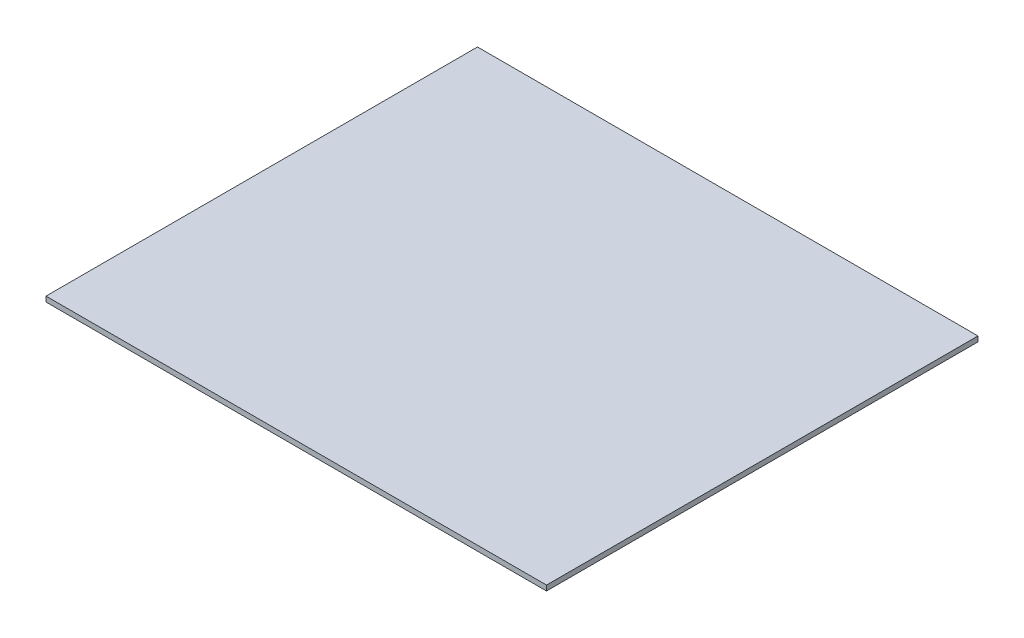
ISO-10303-21;
HEADER;
FILE_DESCRIPTION(('STEP AP214'),'2;1');
FILE_NAME('part.step','',(''),(''),'','','');
FILE_SCHEMA(('AUTOMOTIVE_DESIGN { 1 0 10303 214 1 1 1 1 }'));
ENDSEC;
DATA;
#1=APPLICATION_CONTEXT('core data for automotive mechanical design processes');
#2=APPLICATION_PROTOCOL_DEFINITION('international standard','automotive_design',2000,#1);
#3=PRODUCT_CONTEXT('',#1,'mechanical');
#4=PRODUCT('Part','Part','',(#3));
#5=PRODUCT_RELATED_PRODUCT_CATEGORY('part','',(#4));
#6=PRODUCT_DEFINITION_FORMATION('','',#4);
#7=PRODUCT_DEFINITION_CONTEXT('part definition',#1,'design');
#8=PRODUCT_DEFINITION('design','',#6,#7);
#9=PRODUCT_DEFINITION_SHAPE('','',#8);
#10=(LENGTH_UNIT() NAMED_UNIT(*) SI_UNIT(.MILLI.,.METRE.));
#11=(NAMED_UNIT(*) PLANE_ANGLE_UNIT() SI_UNIT($,.RADIAN.));
#12=(NAMED_UNIT(*) SI_UNIT($,.STERADIAN.) SOLID_ANGLE_UNIT());
#13=UNCERTAINTY_MEASURE_WITH_UNIT(LENGTH_MEASURE(1.E-05),#10,'distance_accuracy_value','');
#14=(GEOMETRIC_REPRESENTATION_CONTEXT(3) GLOBAL_UNCERTAINTY_ASSIGNED_CONTEXT((#13)) GLOBAL_UNIT_ASSIGNED_CONTEXT((#10,
#11,#12)) REPRESENTATION_CONTEXT('',''));
#15=CARTESIAN_POINT('',(0.,0.,0.));
#16=DIRECTION('',(0.,0.,1.));
#17=DIRECTION('',(1.,0.,0.));
#18=AXIS2_PLACEMENT_3D('',#15,#16,#17);
#19=CARTESIAN_POINT('',(0.,-199.12589102772,0.));
#20=DIRECTION('',(0.,-1.,0.));
#21=DIRECTION('',(1.,0.,0.));
#22=AXIS2_PLACEMENT_3D('',#19,#20,#21);
#23=PLANE('',#22);
#24=DIRECTION('',(1.,0.,0.));
#25=VECTOR('',#24,1.);
#26=CARTESIAN_POINT('',(0.,-199.12589102772,331.360192017674));
#27=LINE('',#26,#25);
#28=CARTESIAN_POINT('',(866.715692012132,-199.125891027721,331.360192017674));
#29=VERTEX_POINT('',#28);
#30=CARTESIAN_POINT('',(1446.71569201213,-199.125891027721,331.360192017674));
#31=VERTEX_POINT('',#30);
#32=EDGE_CURVE('E123',#29,#31,#27,.T.);
#33=ORIENTED_EDGE('',*,*,#32,.F.);
#34=DIRECTION('',(0.,0.,1.));
#35=VECTOR('',#34,1.);
#36=CARTESIAN_POINT('',(866.715692012132,-199.125891027721,0.));
#37=LINE('',#36,#35);
#38=CARTESIAN_POINT('',(866.715692012132,-199.125891027721,831.360192017674));
#39=VERTEX_POINT('',#38);
#40=EDGE_CURVE('E128',#29,#39,#37,.T.);
#41=ORIENTED_EDGE('',*,*,#40,.T.);
#42=DIRECTION('',(1.,0.,0.));
#43=VECTOR('',#42,1.);
#44=CARTESIAN_POINT('',(0.,-199.12589102772,831.360192017674));
#45=LINE('',#44,#43);
#46=CARTESIAN_POINT('',(1446.71569201213,-199.125891027721,831.360192017674));
#47=VERTEX_POINT('',#46);
#48=EDGE_CURVE('E126',#39,#47,#45,.T.);
#49=ORIENTED_EDGE('',*,*,#48,.T.);
#50=DIRECTION('',(0.,0.,1.));
#51=VECTOR('',#50,1.);
#52=CARTESIAN_POINT('',(1446.71569201213,-199.125891027721,0.));
#53=LINE('',#52,#51);
#54=EDGE_CURVE('E114',#31,#47,#53,.T.);
#55=ORIENTED_EDGE('',*,*,#54,.F.);
#56=EDGE_LOOP('',(#33,#41,#49,#55));
#57=FACE_BOUND('',#56,.T.);
#58=ADVANCED_FACE('F59',(#57),#23,.F.);
#59=CARTESIAN_POINT('',(1446.71569201213,-205.125891027721,0.));
#60=DIRECTION('',(-1.,0.,0.));
#61=DIRECTION('',(0.,-1.,0.));
#62=AXIS2_PLACEMENT_3D('',#59,#60,#61);
#63=PLANE('',#62);
#64=ORIENTED_EDGE('',*,*,#54,.T.);
#65=DIRECTION('',(0.,1.,0.));
#66=VECTOR('',#65,1.);
#67=CARTESIAN_POINT('',(1446.71569201213,-205.125891027721,831.360192017674));
#68=LINE('',#67,#66);
#69=CARTESIAN_POINT('',(1446.71569201213,-205.125891027721,831.360192017674));
#70=VERTEX_POINT('',#69);
#71=EDGE_CURVE('E68',#70,#47,#68,.T.);
#72=ORIENTED_EDGE('',*,*,#71,.F.);
#73=DIRECTION('',(0.,0.,1.));
#74=VECTOR('',#73,1.);
#75=CARTESIAN_POINT('',(1446.71569201213,-205.125891027721,0.));
#76=LINE('',#75,#74);
#77=CARTESIAN_POINT('',(1446.71569201213,-205.125891027721,331.360192017674));
#78=VERTEX_POINT('',#77);
#79=EDGE_CURVE('E101',#78,#70,#76,.T.);
#80=ORIENTED_EDGE('',*,*,#79,.F.);
#81=DIRECTION('',(0.,1.,0.));
#82=VECTOR('',#81,1.);
#83=CARTESIAN_POINT('',(1446.71569201213,-205.125891027721,331.360192017674));
#84=LINE('',#83,#82);
#85=EDGE_CURVE('E12',#78,#31,#84,.T.);
#86=ORIENTED_EDGE('',*,*,#85,.T.);
#87=EDGE_LOOP('',(#64,#72,#80,#86));
#88=FACE_BOUND('',#87,.T.);
#89=ADVANCED_FACE('F113',(#88),#63,.F.);
#90=CARTESIAN_POINT('',(0.,-205.12589102772,331.360192017674));
#91=DIRECTION('',(0.,0.,1.));
#92=DIRECTION('',(0.,-1.,0.));
#93=AXIS2_PLACEMENT_3D('',#90,#91,#92);
#94=PLANE('',#93);
#95=ORIENTED_EDGE('',*,*,#32,.T.);
#96=ORIENTED_EDGE('',*,*,#85,.F.);
#97=DIRECTION('',(1.,0.,0.));
#98=VECTOR('',#97,1.);
#99=CARTESIAN_POINT('',(0.,-205.12589102772,331.360192017674));
#100=LINE('',#99,#98);
#101=CARTESIAN_POINT('',(866.715692012132,-205.125891027721,331.360192017674));
#102=VERTEX_POINT('',#101);
#103=EDGE_CURVE('E109',#102,#78,#100,.T.);
#104=ORIENTED_EDGE('',*,*,#103,.F.);
#105=DIRECTION('',(0.,1.,0.));
#106=VECTOR('',#105,1.);
#107=CARTESIAN_POINT('',(866.715692012132,-205.125891027721,331.360192017674));
#108=LINE('',#107,#106);
#109=EDGE_CURVE('E76',#102,#29,#108,.T.);
#110=ORIENTED_EDGE('',*,*,#109,.T.);
#111=EDGE_LOOP('',(#95,#96,#104,#110));
#112=FACE_BOUND('',#111,.T.);
#113=ADVANCED_FACE('F61',(#112),#94,.F.);
#114=CARTESIAN_POINT('',(866.715692012132,-205.125891027721,0.));
#115=DIRECTION('',(-1.,0.,0.));
#116=DIRECTION('',(0.,-1.,0.));
#117=AXIS2_PLACEMENT_3D('',#114,#115,#116);
#118=PLANE('',#117);
#119=ORIENTED_EDGE('',*,*,#40,.F.);
#120=ORIENTED_EDGE('',*,*,#109,.F.);
#121=DIRECTION('',(0.,0.,1.));
#122=VECTOR('',#121,1.);
#123=CARTESIAN_POINT('',(866.715692012132,-205.125891027721,0.));
#124=LINE('',#123,#122);
#125=CARTESIAN_POINT('',(866.715692012132,-205.125891027721,831.360192017674));
#126=VERTEX_POINT('',#125);
#127=EDGE_CURVE('E118',#102,#126,#124,.T.);
#128=ORIENTED_EDGE('',*,*,#127,.T.);
#129=DIRECTION('',(0.,1.,0.));
#130=VECTOR('',#129,1.);
#131=CARTESIAN_POINT('',(866.715692012132,-205.125891027721,831.360192017674));
#132=LINE('',#131,#130);
#133=EDGE_CURVE('E90',#126,#39,#132,.T.);
#134=ORIENTED_EDGE('',*,*,#133,.T.);
#135=EDGE_LOOP('',(#119,#120,#128,#134));
#136=FACE_BOUND('',#135,.T.);
#137=ADVANCED_FACE('F133',(#136),#118,.T.);
#138=CARTESIAN_POINT('',(0.,-205.12589102772,831.360192017674));
#139=DIRECTION('',(0.,0.,1.));
#140=DIRECTION('',(0.,-1.,0.));
#141=AXIS2_PLACEMENT_3D('',#138,#139,#140);
#142=PLANE('',#141);
#143=ORIENTED_EDGE('',*,*,#48,.F.);
#144=ORIENTED_EDGE('',*,*,#133,.F.);
#145=DIRECTION('',(1.,0.,0.));
#146=VECTOR('',#145,1.);
#147=CARTESIAN_POINT('',(0.,-205.12589102772,831.360192017674));
#148=LINE('',#147,#146);
#149=EDGE_CURVE('E108',#126,#70,#148,.T.);
#150=ORIENTED_EDGE('',*,*,#149,.T.);
#151=ORIENTED_EDGE('',*,*,#71,.T.);
#152=EDGE_LOOP('',(#143,#144,#150,#151));
#153=FACE_BOUND('',#152,.T.);
#154=ADVANCED_FACE('F117',(#153),#142,.T.);
#155=CARTESIAN_POINT('',(0.,-205.12589102772,0.));
#156=DIRECTION('',(0.,-1.,0.));
#157=DIRECTION('',(1.,0.,0.));
#158=AXIS2_PLACEMENT_3D('',#155,#156,#157);
#159=PLANE('',#158);
#160=ORIENTED_EDGE('',*,*,#103,.T.);
#161=ORIENTED_EDGE('',*,*,#79,.T.);
#162=ORIENTED_EDGE('',*,*,#149,.F.);
#163=ORIENTED_EDGE('',*,*,#127,.F.);
#164=EDGE_LOOP('',(#160,#161,#162,#163));
#165=FACE_BOUND('',#164,.T.);
#166=ADVANCED_FACE('F105',(#165),#159,.T.);
#167=CLOSED_SHELL('',(#58,#89,#113,#137,#154,#166));
#168=MANIFOLD_SOLID_BREP('B2',#167);
#169=ADVANCED_BREP_SHAPE_REPRESENTATION('',(#18,#168),#14);
#170=SHAPE_DEFINITION_REPRESENTATION(#9,#169);
ENDSEC;
END-ISO-10303-21;
